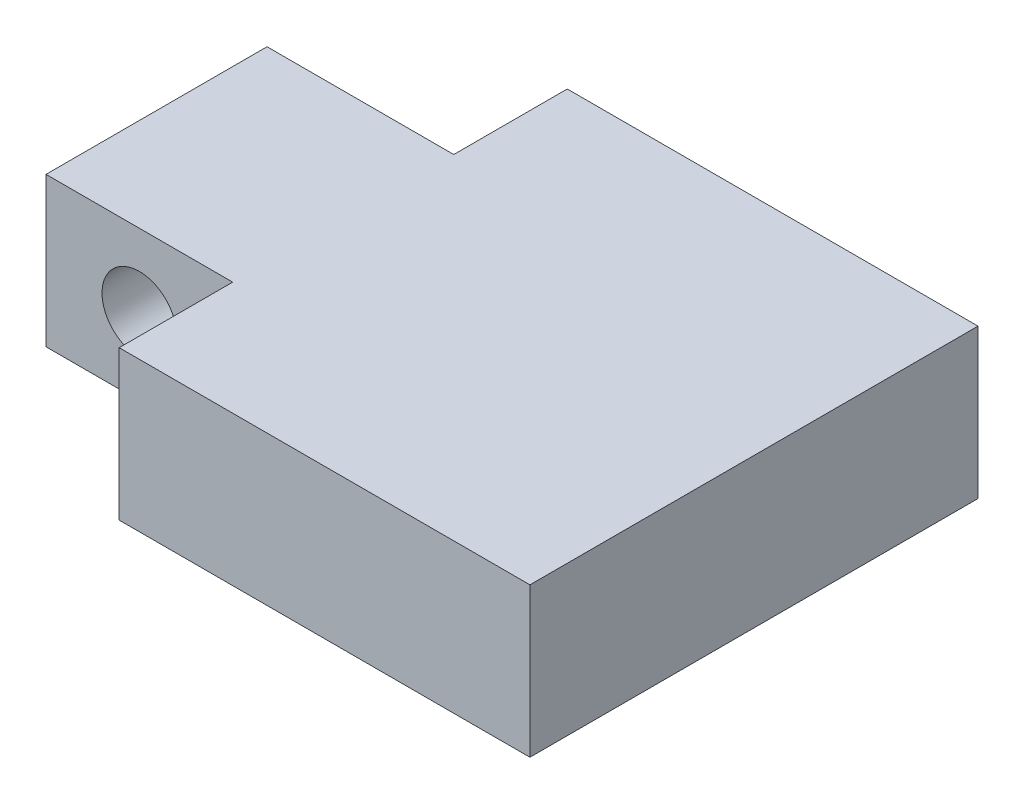
ISO-10303-21;
HEADER;
FILE_DESCRIPTION(('STEP AP214'),'2;1');
FILE_NAME('part.step','',(''),(''),'','','');
FILE_SCHEMA(('AUTOMOTIVE_DESIGN { 1 0 10303 214 1 1 1 1 }'));
ENDSEC;
DATA;
#1=APPLICATION_CONTEXT('core data for automotive mechanical design processes');
#2=APPLICATION_PROTOCOL_DEFINITION('international standard','automotive_design',2000,#1);
#3=PRODUCT_CONTEXT('',#1,'mechanical');
#4=PRODUCT('Part','Part','',(#3));
#5=PRODUCT_RELATED_PRODUCT_CATEGORY('part','',(#4));
#6=PRODUCT_DEFINITION_FORMATION('','',#4);
#7=PRODUCT_DEFINITION_CONTEXT('part definition',#1,'design');
#8=PRODUCT_DEFINITION('design','',#6,#7);
#9=PRODUCT_DEFINITION_SHAPE('','',#8);
#10=(LENGTH_UNIT() NAMED_UNIT(*) SI_UNIT(.MILLI.,.METRE.));
#11=(NAMED_UNIT(*) PLANE_ANGLE_UNIT() SI_UNIT($,.RADIAN.));
#12=(NAMED_UNIT(*) SI_UNIT($,.STERADIAN.) SOLID_ANGLE_UNIT());
#13=UNCERTAINTY_MEASURE_WITH_UNIT(LENGTH_MEASURE(1.E-05),#10,'distance_accuracy_value','');
#14=(GEOMETRIC_REPRESENTATION_CONTEXT(3) GLOBAL_UNCERTAINTY_ASSIGNED_CONTEXT((#13)) GLOBAL_UNIT_ASSIGNED_CONTEXT((#10,
#11,#12)) REPRESENTATION_CONTEXT('',''));
#15=CARTESIAN_POINT('',(0.,0.,0.));
#16=DIRECTION('',(0.,0.,1.));
#17=DIRECTION('',(1.,0.,0.));
#18=AXIS2_PLACEMENT_3D('',#15,#16,#17);
#19=CARTESIAN_POINT('',(-50.8,25.4,38.1));
#20=DIRECTION('',(1.,0.,0.));
#21=DIRECTION('',(0.,0.,-1.));
#22=AXIS2_PLACEMENT_3D('',#19,#20,#21);
#23=PLANE('',#22);
#24=DIRECTION('',(0.,0.,1.));
#25=VECTOR('',#24,1.);
#26=CARTESIAN_POINT('',(-50.8,25.4,38.1));
#27=LINE('',#26,#25);
#28=CARTESIAN_POINT('',(-50.8,25.4,-18.796));
#29=VERTEX_POINT('',#28);
#30=CARTESIAN_POINT('',(-50.8,25.4,18.796));
#31=VERTEX_POINT('',#30);
#32=EDGE_CURVE('E179',#29,#31,#27,.T.);
#33=ORIENTED_EDGE('',*,*,#32,.F.);
#34=DIRECTION('',(0.,1.,0.));
#35=VECTOR('',#34,1.);
#36=CARTESIAN_POINT('',(-50.8,0.,-18.796));
#37=LINE('',#36,#35);
#38=CARTESIAN_POINT('',(-50.8,0.,-18.796));
#39=VERTEX_POINT('',#38);
#40=EDGE_CURVE('E141',#39,#29,#37,.T.);
#41=ORIENTED_EDGE('',*,*,#40,.F.);
#42=DIRECTION('',(0.,0.,1.));
#43=VECTOR('',#42,1.);
#44=CARTESIAN_POINT('',(-50.8,0.,38.1));
#45=LINE('',#44,#43);
#46=CARTESIAN_POINT('',(-50.8,0.,18.796));
#47=VERTEX_POINT('',#46);
#48=EDGE_CURVE('E130',#39,#47,#45,.T.);
#49=ORIENTED_EDGE('',*,*,#48,.T.);
#50=DIRECTION('',(0.,1.,0.));
#51=VECTOR('',#50,1.);
#52=CARTESIAN_POINT('',(-50.8,0.,18.796));
#53=LINE('',#52,#51);
#54=EDGE_CURVE('E154',#47,#31,#53,.T.);
#55=ORIENTED_EDGE('',*,*,#54,.T.);
#56=EDGE_LOOP('',(#33,#41,#49,#55));
#57=FACE_BOUND('',#56,.T.);
#58=ADVANCED_FACE('F43',(#57),#23,.F.);
#59=CARTESIAN_POINT('',(-50.8,25.4,38.1));
#60=DIRECTION('',(0.,0.,-1.));
#61=DIRECTION('',(-1.,0.,0.));
#62=AXIS2_PLACEMENT_3D('',#59,#60,#61);
#63=PLANE('',#62);
#64=DIRECTION('',(0.,1.,0.));
#65=VECTOR('',#64,1.);
#66=CARTESIAN_POINT('',(-19.05,0.,38.1));
#67=LINE('',#66,#65);
#68=CARTESIAN_POINT('',(-19.05,0.,38.1));
#69=VERTEX_POINT('',#68);
#70=CARTESIAN_POINT('',(-19.05,25.4,38.1));
#71=VERTEX_POINT('',#70);
#72=EDGE_CURVE('E164',#69,#71,#67,.T.);
#73=ORIENTED_EDGE('',*,*,#72,.F.);
#74=DIRECTION('',(1.,0.,0.));
#75=VECTOR('',#74,1.);
#76=CARTESIAN_POINT('',(-50.8,0.,38.1));
#77=LINE('',#76,#75);
#78=CARTESIAN_POINT('',(50.8,0.,38.1));
#79=VERTEX_POINT('',#78);
#80=EDGE_CURVE('E175',#69,#79,#77,.T.);
#81=ORIENTED_EDGE('',*,*,#80,.T.);
#82=DIRECTION('',(0.,-1.,0.));
#83=VECTOR('',#82,1.);
#84=CARTESIAN_POINT('',(50.8,25.4,38.1));
#85=LINE('',#84,#83);
#86=CARTESIAN_POINT('',(50.8,25.4,38.1));
#87=VERTEX_POINT('',#86);
#88=EDGE_CURVE('E53',#87,#79,#85,.T.);
#89=ORIENTED_EDGE('',*,*,#88,.F.);
#90=DIRECTION('',(1.,0.,0.));
#91=VECTOR('',#90,1.);
#92=CARTESIAN_POINT('',(-50.8,25.4,38.1));
#93=LINE('',#92,#91);
#94=EDGE_CURVE('E183',#71,#87,#93,.T.);
#95=ORIENTED_EDGE('',*,*,#94,.F.);
#96=EDGE_LOOP('',(#73,#81,#89,#95));
#97=FACE_BOUND('',#96,.T.);
#98=ADVANCED_FACE('F212',(#97),#63,.F.);
#99=CARTESIAN_POINT('',(0.,25.4,0.));
#100=DIRECTION('',(0.,-1.,0.));
#101=DIRECTION('',(0.,0.,-1.));
#102=AXIS2_PLACEMENT_3D('',#99,#100,#101);
#103=PLANE('',#102);
#104=DIRECTION('',(0.,0.,-1.));
#105=VECTOR('',#104,1.);
#106=CARTESIAN_POINT('',(-19.05,25.4,0.));
#107=LINE('',#106,#105);
#108=CARTESIAN_POINT('',(-19.05,25.4,-18.796));
#109=VERTEX_POINT('',#108);
#110=CARTESIAN_POINT('',(-19.05,25.4,-38.1));
#111=VERTEX_POINT('',#110);
#112=EDGE_CURVE('E132',#109,#111,#107,.T.);
#113=ORIENTED_EDGE('',*,*,#112,.F.);
#114=DIRECTION('',(1.,0.,0.));
#115=VECTOR('',#114,1.);
#116=CARTESIAN_POINT('',(0.,25.4,-18.796));
#117=LINE('',#116,#115);
#118=EDGE_CURVE('E116',#29,#109,#117,.T.);
#119=ORIENTED_EDGE('',*,*,#118,.F.);
#120=ORIENTED_EDGE('',*,*,#32,.T.);
#121=DIRECTION('',(1.,0.,0.));
#122=VECTOR('',#121,1.);
#123=CARTESIAN_POINT('',(0.,25.4,18.796));
#124=LINE('',#123,#122);
#125=CARTESIAN_POINT('',(-19.05,25.4,18.796));
#126=VERTEX_POINT('',#125);
#127=EDGE_CURVE('E155',#31,#126,#124,.T.);
#128=ORIENTED_EDGE('',*,*,#127,.T.);
#129=DIRECTION('',(0.,0.,1.));
#130=VECTOR('',#129,1.);
#131=CARTESIAN_POINT('',(-19.05,25.4,0.));
#132=LINE('',#131,#130);
#133=EDGE_CURVE('E151',#126,#71,#132,.T.);
#134=ORIENTED_EDGE('',*,*,#133,.T.);
#135=ORIENTED_EDGE('',*,*,#94,.T.);
#136=DIRECTION('',(0.,0.,-1.));
#137=VECTOR('',#136,1.);
#138=CARTESIAN_POINT('',(50.8,25.4,38.1));
#139=LINE('',#138,#137);
#140=CARTESIAN_POINT('',(50.8,25.4,-38.1));
#141=VERTEX_POINT('',#140);
#142=EDGE_CURVE('E170',#87,#141,#139,.T.);
#143=ORIENTED_EDGE('',*,*,#142,.T.);
#144=DIRECTION('',(-1.,0.,0.));
#145=VECTOR('',#144,1.);
#146=CARTESIAN_POINT('',(-50.8,25.4,-38.1));
#147=LINE('',#146,#145);
#148=EDGE_CURVE('E174',#141,#111,#147,.T.);
#149=ORIENTED_EDGE('',*,*,#148,.T.);
#150=EDGE_LOOP('',(#113,#119,#120,#128,#134,#135,#143,#149));
#151=FACE_BOUND('',#150,.T.);
#152=ADVANCED_FACE('F210',(#151),#103,.F.);
#153=CARTESIAN_POINT('',(0.,0.,0.));
#154=DIRECTION('',(0.,-1.,0.));
#155=DIRECTION('',(0.,0.,-1.));
#156=AXIS2_PLACEMENT_3D('',#153,#154,#155);
#157=PLANE('',#156);
#158=DIRECTION('',(1.,0.,0.));
#159=VECTOR('',#158,1.);
#160=CARTESIAN_POINT('',(0.,0.,-18.796));
#161=LINE('',#160,#159);
#162=CARTESIAN_POINT('',(-19.05,0.,-18.796));
#163=VERTEX_POINT('',#162);
#164=EDGE_CURVE('E113',#39,#163,#161,.T.);
#165=ORIENTED_EDGE('',*,*,#164,.T.);
#166=DIRECTION('',(0.,0.,-1.));
#167=VECTOR('',#166,1.);
#168=CARTESIAN_POINT('',(-19.05,0.,0.));
#169=LINE('',#168,#167);
#170=CARTESIAN_POINT('',(-19.05,0.,-38.1));
#171=VERTEX_POINT('',#170);
#172=EDGE_CURVE('E119',#163,#171,#169,.T.);
#173=ORIENTED_EDGE('',*,*,#172,.T.);
#174=DIRECTION('',(-1.,0.,0.));
#175=VECTOR('',#174,1.);
#176=CARTESIAN_POINT('',(-50.8,0.,-38.1));
#177=LINE('',#176,#175);
#178=CARTESIAN_POINT('',(50.8,0.,-38.1));
#179=VERTEX_POINT('',#178);
#180=EDGE_CURVE('E189',#179,#171,#177,.T.);
#181=ORIENTED_EDGE('',*,*,#180,.F.);
#182=DIRECTION('',(0.,0.,-1.));
#183=VECTOR('',#182,1.);
#184=CARTESIAN_POINT('',(50.8,0.,38.1));
#185=LINE('',#184,#183);
#186=EDGE_CURVE('E144',#79,#179,#185,.T.);
#187=ORIENTED_EDGE('',*,*,#186,.F.);
#188=ORIENTED_EDGE('',*,*,#80,.F.);
#189=DIRECTION('',(0.,0.,1.));
#190=VECTOR('',#189,1.);
#191=CARTESIAN_POINT('',(-19.05,0.,0.));
#192=LINE('',#191,#190);
#193=CARTESIAN_POINT('',(-19.05,0.,18.796));
#194=VERTEX_POINT('',#193);
#195=EDGE_CURVE('E150',#194,#69,#192,.T.);
#196=ORIENTED_EDGE('',*,*,#195,.F.);
#197=DIRECTION('',(1.,0.,0.));
#198=VECTOR('',#197,1.);
#199=CARTESIAN_POINT('',(0.,0.,18.796));
#200=LINE('',#199,#198);
#201=EDGE_CURVE('E147',#47,#194,#200,.T.);
#202=ORIENTED_EDGE('',*,*,#201,.F.);
#203=ORIENTED_EDGE('',*,*,#48,.F.);
#204=EDGE_LOOP('',(#165,#173,#181,#187,#188,#196,#202,#203));
#205=FACE_BOUND('',#204,.T.);
#206=ADVANCED_FACE('F127',(#205),#157,.T.);
#207=CARTESIAN_POINT('',(50.8,25.4,38.1));
#208=DIRECTION('',(-1.,0.,0.));
#209=DIRECTION('',(0.,0.,1.));
#210=AXIS2_PLACEMENT_3D('',#207,#208,#209);
#211=PLANE('',#210);
#212=ORIENTED_EDGE('',*,*,#186,.T.);
#213=DIRECTION('',(0.,-1.,0.));
#214=VECTOR('',#213,1.);
#215=CARTESIAN_POINT('',(50.8,25.4,-38.1));
#216=LINE('',#215,#214);
#217=EDGE_CURVE('E11',#141,#179,#216,.T.);
#218=ORIENTED_EDGE('',*,*,#217,.F.);
#219=ORIENTED_EDGE('',*,*,#142,.F.);
#220=ORIENTED_EDGE('',*,*,#88,.T.);
#221=EDGE_LOOP('',(#212,#218,#219,#220));
#222=FACE_BOUND('',#221,.T.);
#223=ADVANCED_FACE('F45',(#222),#211,.F.);
#224=CARTESIAN_POINT('',(-50.8,25.4,-38.1));
#225=DIRECTION('',(0.,0.,1.));
#226=DIRECTION('',(1.,0.,0.));
#227=AXIS2_PLACEMENT_3D('',#224,#225,#226);
#228=PLANE('',#227);
#229=ORIENTED_EDGE('',*,*,#180,.T.);
#230=DIRECTION('',(0.,1.,0.));
#231=VECTOR('',#230,1.);
#232=CARTESIAN_POINT('',(-19.05,0.,-38.1));
#233=LINE('',#232,#231);
#234=EDGE_CURVE('E68',#171,#111,#233,.T.);
#235=ORIENTED_EDGE('',*,*,#234,.T.);
#236=ORIENTED_EDGE('',*,*,#148,.F.);
#237=ORIENTED_EDGE('',*,*,#217,.T.);
#238=EDGE_LOOP('',(#229,#235,#236,#237));
#239=FACE_BOUND('',#238,.T.);
#240=ADVANCED_FACE('F208',(#239),#228,.F.);
#241=CARTESIAN_POINT('',(0.,0.,18.796));
#242=DIRECTION('',(0.,0.,1.));
#243=DIRECTION('',(1.,0.,0.));
#244=AXIS2_PLACEMENT_3D('',#241,#242,#243);
#245=PLANE('',#244);
#246=CARTESIAN_POINT('',(-34.925,12.7,18.796));
#247=DIRECTION('',(0.,0.,1.));
#248=DIRECTION('',(1.,0.,0.));
#249=AXIS2_PLACEMENT_3D('',#246,#247,#248);
#250=CIRCLE('',#249,6.35);
#251=CARTESIAN_POINT('',(-28.575,12.7,18.796));
#252=VERTEX_POINT('',#251);
#253=EDGE_CURVE('E137',#252,#252,#250,.T.);
#254=ORIENTED_EDGE('',*,*,#253,.F.);
#255=EDGE_LOOP('',(#254));
#256=FACE_BOUND('',#255,.T.);
#257=ORIENTED_EDGE('',*,*,#127,.F.);
#258=ORIENTED_EDGE('',*,*,#54,.F.);
#259=ORIENTED_EDGE('',*,*,#201,.T.);
#260=DIRECTION('',(0.,1.,0.));
#261=VECTOR('',#260,1.);
#262=CARTESIAN_POINT('',(-19.05,0.,18.796));
#263=LINE('',#262,#261);
#264=EDGE_CURVE('E60',#194,#126,#263,.T.);
#265=ORIENTED_EDGE('',*,*,#264,.T.);
#266=EDGE_LOOP('',(#257,#258,#259,#265));
#267=FACE_BOUND('',#266,.T.);
#268=ADVANCED_FACE('F217',(#256,#267),#245,.T.);
#269=CARTESIAN_POINT('',(-19.05,0.,0.));
#270=DIRECTION('',(-1.,0.,0.));
#271=DIRECTION('',(0.,0.,1.));
#272=AXIS2_PLACEMENT_3D('',#269,#270,#271);
#273=PLANE('',#272);
#274=ORIENTED_EDGE('',*,*,#133,.F.);
#275=ORIENTED_EDGE('',*,*,#264,.F.);
#276=ORIENTED_EDGE('',*,*,#195,.T.);
#277=ORIENTED_EDGE('',*,*,#72,.T.);
#278=EDGE_LOOP('',(#274,#275,#276,#277));
#279=FACE_BOUND('',#278,.T.);
#280=ADVANCED_FACE('F213',(#279),#273,.T.);
#281=CARTESIAN_POINT('',(0.,0.,-18.796));
#282=DIRECTION('',(0.,0.,1.));
#283=DIRECTION('',(1.,0.,0.));
#284=AXIS2_PLACEMENT_3D('',#281,#282,#283);
#285=PLANE('',#284);
#286=CARTESIAN_POINT('',(-34.925,12.7,-18.796));
#287=DIRECTION('',(0.,0.,1.));
#288=DIRECTION('',(1.,0.,0.));
#289=AXIS2_PLACEMENT_3D('',#286,#287,#288);
#290=CIRCLE('',#289,6.35);
#291=CARTESIAN_POINT('',(-28.575,12.7,-18.796));
#292=VERTEX_POINT('',#291);
#293=EDGE_CURVE('E47',#292,#292,#290,.T.);
#294=ORIENTED_EDGE('',*,*,#293,.T.);
#295=EDGE_LOOP('',(#294));
#296=FACE_BOUND('',#295,.T.);
#297=ORIENTED_EDGE('',*,*,#118,.T.);
#298=DIRECTION('',(0.,1.,0.));
#299=VECTOR('',#298,1.);
#300=CARTESIAN_POINT('',(-19.05,0.,-18.796));
#301=LINE('',#300,#299);
#302=EDGE_CURVE('E110',#163,#109,#301,.T.);
#303=ORIENTED_EDGE('',*,*,#302,.F.);
#304=ORIENTED_EDGE('',*,*,#164,.F.);
#305=ORIENTED_EDGE('',*,*,#40,.T.);
#306=EDGE_LOOP('',(#297,#303,#304,#305));
#307=FACE_BOUND('',#306,.T.);
#308=ADVANCED_FACE('F111',(#296,#307),#285,.F.);
#309=CARTESIAN_POINT('',(-19.05,0.,0.));
#310=DIRECTION('',(1.,0.,0.));
#311=DIRECTION('',(0.,0.,-1.));
#312=AXIS2_PLACEMENT_3D('',#309,#310,#311);
#313=PLANE('',#312);
#314=ORIENTED_EDGE('',*,*,#112,.T.);
#315=ORIENTED_EDGE('',*,*,#234,.F.);
#316=ORIENTED_EDGE('',*,*,#172,.F.);
#317=ORIENTED_EDGE('',*,*,#302,.T.);
#318=EDGE_LOOP('',(#314,#315,#316,#317));
#319=FACE_BOUND('',#318,.T.);
#320=ADVANCED_FACE('F121',(#319),#313,.F.);
#321=CARTESIAN_POINT('',(-34.925,12.7,-38.1));
#322=DIRECTION('',(0.,0.,1.));
#323=DIRECTION('',(1.,0.,0.));
#324=AXIS2_PLACEMENT_3D('',#321,#322,#323);
#325=CYLINDRICAL_SURFACE('',#324,6.35);
#326=ORIENTED_EDGE('',*,*,#253,.T.);
#327=EDGE_LOOP('',(#326));
#328=FACE_BOUND('',#327,.T.);
#329=ORIENTED_EDGE('',*,*,#293,.F.);
#330=EDGE_LOOP('',(#329));
#331=FACE_BOUND('',#330,.T.);
#332=ADVANCED_FACE('F274',(#328,#331),#325,.F.);
#333=CLOSED_SHELL('',(#58,#98,#152,#206,#223,#240,#268,#280,#308,#320,#332));
#334=MANIFOLD_SOLID_BREP('B2',#333);
#335=ADVANCED_BREP_SHAPE_REPRESENTATION('',(#18,#334),#14);
#336=SHAPE_DEFINITION_REPRESENTATION(#9,#335);
ENDSEC;
END-ISO-10303-21;
